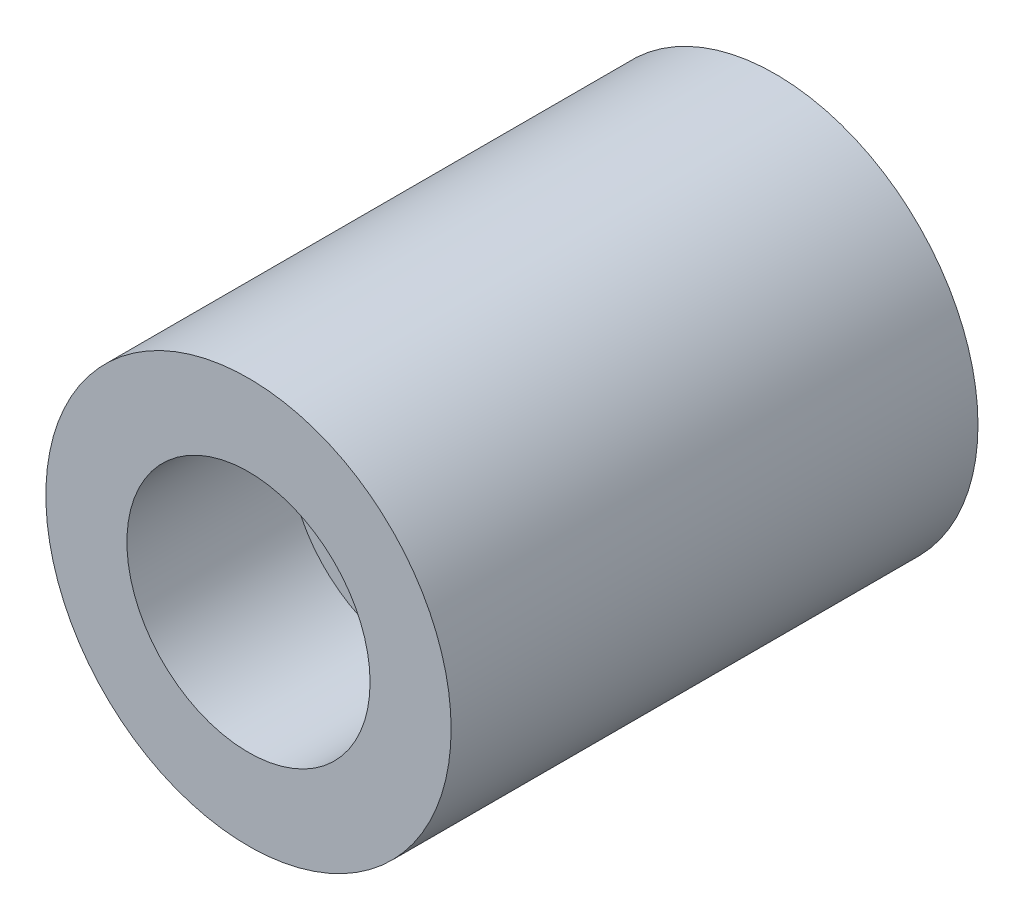
ISO-10303-21;
HEADER;
FILE_DESCRIPTION(('STEP AP214'),'2;1');
FILE_NAME('part.step','',(''),(''),'','','');
FILE_SCHEMA(('AUTOMOTIVE_DESIGN { 1 0 10303 214 1 1 1 1 }'));
ENDSEC;
DATA;
#1=APPLICATION_CONTEXT('core data for automotive mechanical design processes');
#2=APPLICATION_PROTOCOL_DEFINITION('international standard','automotive_design',2000,#1);
#3=PRODUCT_CONTEXT('',#1,'mechanical');
#4=PRODUCT('Part','Part','',(#3));
#5=PRODUCT_RELATED_PRODUCT_CATEGORY('part','',(#4));
#6=PRODUCT_DEFINITION_FORMATION('','',#4);
#7=PRODUCT_DEFINITION_CONTEXT('part definition',#1,'design');
#8=PRODUCT_DEFINITION('design','',#6,#7);
#9=PRODUCT_DEFINITION_SHAPE('','',#8);
#10=(LENGTH_UNIT() NAMED_UNIT(*) SI_UNIT(.MILLI.,.METRE.));
#11=(NAMED_UNIT(*) PLANE_ANGLE_UNIT() SI_UNIT($,.RADIAN.));
#12=(NAMED_UNIT(*) SI_UNIT($,.STERADIAN.) SOLID_ANGLE_UNIT());
#13=UNCERTAINTY_MEASURE_WITH_UNIT(LENGTH_MEASURE(1.E-05),#10,'distance_accuracy_value','');
#14=(GEOMETRIC_REPRESENTATION_CONTEXT(3) GLOBAL_UNCERTAINTY_ASSIGNED_CONTEXT((#13)) GLOBAL_UNIT_ASSIGNED_CONTEXT((#10,
#11,#12)) REPRESENTATION_CONTEXT('',''));
#15=CARTESIAN_POINT('',(0.,0.,0.));
#16=DIRECTION('',(0.,0.,1.));
#17=DIRECTION('',(1.,0.,0.));
#18=AXIS2_PLACEMENT_3D('',#15,#16,#17);
#19=CARTESIAN_POINT('',(0.,0.,130.));
#20=DIRECTION('',(0.,0.,-1.));
#21=DIRECTION('',(-1.,0.,0.));
#22=AXIS2_PLACEMENT_3D('',#19,#20,#21);
#23=CYLINDRICAL_SURFACE('',#22,50.);
#24=CARTESIAN_POINT('',(0.,0.,130.));
#25=DIRECTION('',(0.,0.,1.));
#26=DIRECTION('',(1.,0.,0.));
#27=AXIS2_PLACEMENT_3D('',#24,#25,#26);
#28=CIRCLE('',#27,50.);
#29=CARTESIAN_POINT('',(50.,0.,130.));
#30=VERTEX_POINT('',#29);
#31=EDGE_CURVE('E10',#30,#30,#28,.T.);
#32=ORIENTED_EDGE('',*,*,#31,.F.);
#33=EDGE_LOOP('',(#32));
#34=FACE_BOUND('',#33,.T.);
#35=CARTESIAN_POINT('',(0.,0.,0.));
#36=DIRECTION('',(0.,0.,1.));
#37=DIRECTION('',(1.,0.,0.));
#38=AXIS2_PLACEMENT_3D('',#35,#36,#37);
#39=CIRCLE('',#38,50.);
#40=CARTESIAN_POINT('',(50.,0.,0.));
#41=VERTEX_POINT('',#40);
#42=EDGE_CURVE('E34',#41,#41,#39,.T.);
#43=ORIENTED_EDGE('',*,*,#42,.T.);
#44=EDGE_LOOP('',(#43));
#45=FACE_BOUND('',#44,.T.);
#46=ADVANCED_FACE('F31',(#34,#45),#23,.T.);
#47=CARTESIAN_POINT('',(0.,0.,130.));
#48=DIRECTION('',(0.,0.,1.));
#49=DIRECTION('',(1.,0.,0.));
#50=AXIS2_PLACEMENT_3D('',#47,#48,#49);
#51=PLANE('',#50);
#52=CARTESIAN_POINT('',(0.,0.,130.));
#53=DIRECTION('',(0.,0.,1.));
#54=DIRECTION('',(1.,0.,0.));
#55=AXIS2_PLACEMENT_3D('',#52,#53,#54);
#56=CIRCLE('',#55,30.);
#57=CARTESIAN_POINT('',(30.,0.,130.));
#58=VERTEX_POINT('',#57);
#59=EDGE_CURVE('E43',#58,#58,#56,.T.);
#60=ORIENTED_EDGE('',*,*,#59,.F.);
#61=EDGE_LOOP('',(#60));
#62=FACE_BOUND('',#61,.T.);
#63=ORIENTED_EDGE('',*,*,#31,.T.);
#64=EDGE_LOOP('',(#63));
#65=FACE_BOUND('',#64,.T.);
#66=ADVANCED_FACE('F76',(#62,#65),#51,.T.);
#67=CARTESIAN_POINT('',(0.,0.,0.));
#68=DIRECTION('',(0.,0.,1.));
#69=DIRECTION('',(1.,0.,0.));
#70=AXIS2_PLACEMENT_3D('',#67,#68,#69);
#71=PLANE('',#70);
#72=ORIENTED_EDGE('',*,*,#42,.F.);
#73=EDGE_LOOP('',(#72));
#74=FACE_BOUND('',#73,.T.);
#75=ADVANCED_FACE('F72',(#74),#71,.F.);
#76=CARTESIAN_POINT('',(0.,0.,90.));
#77=DIRECTION('',(0.,0.,1.));
#78=DIRECTION('',(1.,0.,0.));
#79=AXIS2_PLACEMENT_3D('',#76,#77,#78);
#80=CYLINDRICAL_SURFACE('',#79,30.);
#81=CARTESIAN_POINT('',(0.,0.,90.));
#82=DIRECTION('',(0.,0.,1.));
#83=DIRECTION('',(1.,0.,0.));
#84=AXIS2_PLACEMENT_3D('',#81,#82,#83);
#85=CIRCLE('',#84,30.);
#86=CARTESIAN_POINT('',(30.,0.,90.));
#87=VERTEX_POINT('',#86);
#88=EDGE_CURVE('E41',#87,#87,#85,.T.);
#89=ORIENTED_EDGE('',*,*,#88,.F.);
#90=EDGE_LOOP('',(#89));
#91=FACE_BOUND('',#90,.T.);
#92=ORIENTED_EDGE('',*,*,#59,.T.);
#93=EDGE_LOOP('',(#92));
#94=FACE_BOUND('',#93,.T.);
#95=ADVANCED_FACE('F66',(#91,#94),#80,.F.);
#96=CARTESIAN_POINT('',(0.,0.,90.));
#97=DIRECTION('',(0.,0.,1.));
#98=DIRECTION('',(1.,0.,0.));
#99=AXIS2_PLACEMENT_3D('',#96,#97,#98);
#100=PLANE('',#99);
#101=CARTESIAN_POINT('',(0.,0.,90.));
#102=DIRECTION('',(0.,0.,1.));
#103=DIRECTION('',(1.,0.,0.));
#104=AXIS2_PLACEMENT_3D('',#101,#102,#103);
#105=CIRCLE('',#104,10.);
#106=CARTESIAN_POINT('',(10.,0.,90.));
#107=VERTEX_POINT('',#106);
#108=EDGE_CURVE('E49',#107,#107,#105,.T.);
#109=ORIENTED_EDGE('',*,*,#108,.F.);
#110=EDGE_LOOP('',(#109));
#111=FACE_BOUND('',#110,.T.);
#112=ORIENTED_EDGE('',*,*,#88,.T.);
#113=EDGE_LOOP('',(#112));
#114=FACE_BOUND('',#113,.T.);
#115=ADVANCED_FACE('F60',(#111,#114),#100,.T.);
#116=CARTESIAN_POINT('',(0.,0.,9.99999999999999));
#117=DIRECTION('',(0.,0.,1.));
#118=DIRECTION('',(1.,0.,0.));
#119=AXIS2_PLACEMENT_3D('',#116,#117,#118);
#120=CYLINDRICAL_SURFACE('',#119,10.);
#121=CARTESIAN_POINT('',(0.,0.,9.99999999999999));
#122=DIRECTION('',(0.,0.,1.));
#123=DIRECTION('',(1.,0.,0.));
#124=AXIS2_PLACEMENT_3D('',#121,#122,#123);
#125=CIRCLE('',#124,10.);
#126=CARTESIAN_POINT('',(10.,0.,9.99999999999999));
#127=VERTEX_POINT('',#126);
#128=EDGE_CURVE('E46',#127,#127,#125,.T.);
#129=ORIENTED_EDGE('',*,*,#128,.F.);
#130=EDGE_LOOP('',(#129));
#131=FACE_BOUND('',#130,.T.);
#132=ORIENTED_EDGE('',*,*,#108,.T.);
#133=EDGE_LOOP('',(#132));
#134=FACE_BOUND('',#133,.T.);
#135=ADVANCED_FACE('F57',(#131,#134),#120,.F.);
#136=CARTESIAN_POINT('',(0.,0.,9.99999999999999));
#137=DIRECTION('',(0.,0.,1.));
#138=DIRECTION('',(1.,0.,0.));
#139=AXIS2_PLACEMENT_3D('',#136,#137,#138);
#140=PLANE('',#139);
#141=ORIENTED_EDGE('',*,*,#128,.T.);
#142=EDGE_LOOP('',(#141));
#143=FACE_BOUND('',#142,.T.);
#144=ADVANCED_FACE('F55',(#143),#140,.T.);
#145=CLOSED_SHELL('',(#46,#66,#75,#95,#115,#135,#144));
#146=MANIFOLD_SOLID_BREP('B2',#145);
#147=ADVANCED_BREP_SHAPE_REPRESENTATION('',(#18,#146),#14);
#148=SHAPE_DEFINITION_REPRESENTATION(#9,#147);
ENDSEC;
END-ISO-10303-21;
